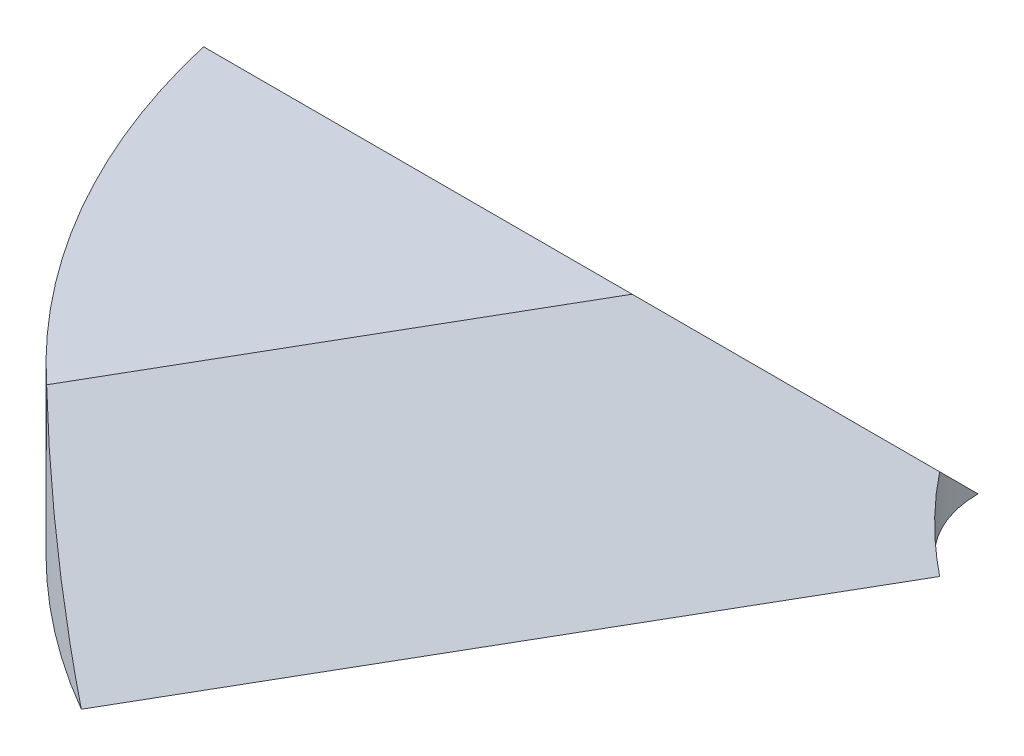
ISO-10303-21;
HEADER;
FILE_DESCRIPTION(('STEP AP214'),'2;1');
FILE_NAME('part.step','',(''),(''),'','','');
FILE_SCHEMA(('AUTOMOTIVE_DESIGN { 1 0 10303 214 1 1 1 1 }'));
ENDSEC;
DATA;
#1=APPLICATION_CONTEXT('core data for automotive mechanical design processes');
#2=APPLICATION_PROTOCOL_DEFINITION('international standard','automotive_design',2000,#1);
#3=PRODUCT_CONTEXT('',#1,'mechanical');
#4=PRODUCT('Part','Part','',(#3));
#5=PRODUCT_RELATED_PRODUCT_CATEGORY('part','',(#4));
#6=PRODUCT_DEFINITION_FORMATION('','',#4);
#7=PRODUCT_DEFINITION_CONTEXT('part definition',#1,'design');
#8=PRODUCT_DEFINITION('design','',#6,#7);
#9=PRODUCT_DEFINITION_SHAPE('','',#8);
#10=(LENGTH_UNIT() NAMED_UNIT(*) SI_UNIT(.MILLI.,.METRE.));
#11=(NAMED_UNIT(*) PLANE_ANGLE_UNIT() SI_UNIT($,.RADIAN.));
#12=(NAMED_UNIT(*) SI_UNIT($,.STERADIAN.) SOLID_ANGLE_UNIT());
#13=UNCERTAINTY_MEASURE_WITH_UNIT(LENGTH_MEASURE(1.E-05),#10,'distance_accuracy_value','');
#14=(GEOMETRIC_REPRESENTATION_CONTEXT(3) GLOBAL_UNCERTAINTY_ASSIGNED_CONTEXT((#13)) GLOBAL_UNIT_ASSIGNED_CONTEXT((#10,
#11,#12)) REPRESENTATION_CONTEXT('',''));
#15=CARTESIAN_POINT('',(0.,0.,0.));
#16=DIRECTION('',(0.,0.,1.));
#17=DIRECTION('',(1.,0.,0.));
#18=AXIS2_PLACEMENT_3D('',#15,#16,#17);
#19=CARTESIAN_POINT('',(0.,10.,0.));
#20=DIRECTION('',(0.,-1.,0.));
#21=DIRECTION('',(0.,0.,-1.));
#22=AXIS2_PLACEMENT_3D('',#19,#20,#21);
#23=CYLINDRICAL_SURFACE('',#22,6.35);
#24=CARTESIAN_POINT('',(0.,0.,0.));
#25=DIRECTION('',(0.,1.,0.));
#26=DIRECTION('',(0.,0.,1.));
#27=AXIS2_PLACEMENT_3D('',#24,#25,#26);
#28=CIRCLE('',#27,6.35);
#29=CARTESIAN_POINT('',(-6.35,0.,0.));
#30=VERTEX_POINT('',#29);
#31=CARTESIAN_POINT('',(-3.175,0.,5.49926131403119));
#32=VERTEX_POINT('',#31);
#33=EDGE_CURVE('E92',#30,#32,#28,.T.);
#34=ORIENTED_EDGE('',*,*,#33,.F.);
#35=CARTESIAN_POINT('',(0.,0.,0.));
#36=DIRECTION('',(0.,0.707106781186549,-0.707106781186546));
#37=DIRECTION('',(0.,-0.707106781186546,-0.707106781186549));
#38=AXIS2_PLACEMENT_3D('',#35,#36,#37);
#39=ELLIPSE('',#38,8.98025612106914,6.35);
#40=CARTESIAN_POINT('',(-5.49926131403119,3.17499999999999,3.175));
#41=VERTEX_POINT('',#40);
#42=EDGE_CURVE('E52',#41,#30,#39,.F.);
#43=ORIENTED_EDGE('',*,*,#42,.F.);
#44=CARTESIAN_POINT('',(0.,0.,0.));
#45=DIRECTION('',(0.612372435695794,0.707106781186549,0.353553390593273));
#46=DIRECTION('',(0.612372435695796,-0.707106781186546,0.353553390593274));
#47=AXIS2_PLACEMENT_3D('',#44,#45,#46);
#48=ELLIPSE('',#47,8.98025612106914,6.35);
#49=EDGE_CURVE('E98',#41,#32,#48,.T.);
#50=ORIENTED_EDGE('',*,*,#49,.T.);
#51=EDGE_LOOP('',(#34,#43,#50));
#52=FACE_BOUND('',#51,.T.);
#53=ADVANCED_FACE('F41',(#52),#23,.F.);
#54=CARTESIAN_POINT('',(0.,0.,0.));
#55=DIRECTION('',(0.,0.707106781186549,-0.707106781186546));
#56=DIRECTION('',(0.,0.707106781186546,0.707106781186549));
#57=AXIS2_PLACEMENT_3D('',#54,#55,#56);
#58=PLANE('',#57);
#59=DIRECTION('',(-1.,0.,0.));
#60=VECTOR('',#59,1.);
#61=CARTESIAN_POINT('',(0.,0.,0.));
#62=LINE('',#61,#60);
#63=CARTESIAN_POINT('',(-44.45,0.,0.));
#64=VERTEX_POINT('',#63);
#65=EDGE_CURVE('E80',#30,#64,#62,.T.);
#66=ORIENTED_EDGE('',*,*,#65,.T.);
#67=CARTESIAN_POINT('',(0.,0.,0.));
#68=DIRECTION('',(0.,0.707106781186549,-0.707106781186546));
#69=DIRECTION('',(0.,-0.707106781186546,-0.707106781186549));
#70=AXIS2_PLACEMENT_3D('',#67,#68,#69);
#71=ELLIPSE('',#70,62.861792847484,44.45);
#72=CARTESIAN_POINT('',(-43.3105356697421,10.,10.));
#73=VERTEX_POINT('',#72);
#74=EDGE_CURVE('E45',#73,#64,#71,.F.);
#75=ORIENTED_EDGE('',*,*,#74,.F.);
#76=DIRECTION('',(1.,0.,0.));
#77=VECTOR('',#76,1.);
#78=CARTESIAN_POINT('',(0.,10.,10.));
#79=LINE('',#78,#77);
#80=CARTESIAN_POINT('',(-17.3205080756888,10.,10.));
#81=VERTEX_POINT('',#80);
#82=EDGE_CURVE('E60',#81,#73,#79,.F.);
#83=ORIENTED_EDGE('',*,*,#82,.F.);
#84=DIRECTION('',(0.774596669241484,-0.447213595499957,-0.447213595499958));
#85=VECTOR('',#84,1.);
#86=CARTESIAN_POINT('',(0.,0.,0.));
#87=LINE('',#86,#85);
#88=EDGE_CURVE('E11',#41,#81,#87,.F.);
#89=ORIENTED_EDGE('',*,*,#88,.F.);
#90=ORIENTED_EDGE('',*,*,#42,.T.);
#91=EDGE_LOOP('',(#66,#75,#83,#89,#90));
#92=FACE_BOUND('',#91,.T.);
#93=ADVANCED_FACE('F43',(#92),#58,.T.);
#94=CARTESIAN_POINT('',(0.,10.,0.));
#95=DIRECTION('',(0.,-1.,0.));
#96=DIRECTION('',(0.,0.,-1.));
#97=AXIS2_PLACEMENT_3D('',#94,#95,#96);
#98=CYLINDRICAL_SURFACE('',#97,44.45);
#99=CARTESIAN_POINT('',(0.,0.,0.));
#100=DIRECTION('',(0.,1.,0.));
#101=DIRECTION('',(0.,0.,1.));
#102=AXIS2_PLACEMENT_3D('',#99,#100,#101);
#103=CIRCLE('',#102,44.45);
#104=CARTESIAN_POINT('',(-22.225,0.,38.4948291982183));
#105=VERTEX_POINT('',#104);
#106=EDGE_CURVE('E95',#64,#105,#103,.T.);
#107=ORIENTED_EDGE('',*,*,#106,.T.);
#108=CARTESIAN_POINT('',(0.,0.,0.));
#109=DIRECTION('',(0.612372435695794,0.707106781186549,0.353553390593273));
#110=DIRECTION('',(0.612372435695796,-0.707106781186546,0.353553390593274));
#111=AXIS2_PLACEMENT_3D('',#108,#109,#110);
#112=ELLIPSE('',#111,62.861792847484,44.45);
#113=CARTESIAN_POINT('',(-30.3155218727155,10.,32.5080241415087));
#114=VERTEX_POINT('',#113);
#115=EDGE_CURVE('E109',#114,#105,#112,.T.);
#116=ORIENTED_EDGE('',*,*,#115,.F.);
#117=CARTESIAN_POINT('',(0.,10.,0.));
#118=DIRECTION('',(0.,1.,0.));
#119=DIRECTION('',(0.,0.,1.));
#120=AXIS2_PLACEMENT_3D('',#117,#118,#119);
#121=CIRCLE('',#120,44.45);
#122=EDGE_CURVE('E102',#73,#114,#121,.T.);
#123=ORIENTED_EDGE('',*,*,#122,.F.);
#124=ORIENTED_EDGE('',*,*,#74,.T.);
#125=EDGE_LOOP('',(#107,#116,#123,#124));
#126=FACE_BOUND('',#125,.T.);
#127=ADVANCED_FACE('F124',(#126),#98,.T.);
#128=CARTESIAN_POINT('',(0.,0.,0.));
#129=DIRECTION('',(0.612372435695794,0.707106781186549,0.353553390593273));
#130=DIRECTION('',(-0.755928946018456,0.654653670707976,0.));
#131=AXIS2_PLACEMENT_3D('',#128,#129,#130);
#132=PLANE('',#131);
#133=DIRECTION('',(-0.5,0.,0.866025403784439));
#134=VECTOR('',#133,1.);
#135=CARTESIAN_POINT('',(0.,0.,0.));
#136=LINE('',#135,#134);
#137=EDGE_CURVE('E106',#32,#105,#136,.T.);
#138=ORIENTED_EDGE('',*,*,#137,.F.);
#139=ORIENTED_EDGE('',*,*,#49,.F.);
#140=ORIENTED_EDGE('',*,*,#88,.T.);
#141=DIRECTION('',(-0.5,0.,0.866025403784439));
#142=VECTOR('',#141,1.);
#143=CARTESIAN_POINT('',(-8.66025403784442,10.,-5.00000000000002));
#144=LINE('',#143,#142);
#145=EDGE_CURVE('E112',#81,#114,#144,.T.);
#146=ORIENTED_EDGE('',*,*,#145,.T.);
#147=ORIENTED_EDGE('',*,*,#115,.T.);
#148=EDGE_LOOP('',(#138,#139,#140,#146,#147));
#149=FACE_BOUND('',#148,.T.);
#150=ADVANCED_FACE('F126',(#149),#132,.T.);
#151=CARTESIAN_POINT('',(0.,10.,0.));
#152=DIRECTION('',(0.,1.,0.));
#153=DIRECTION('',(0.,0.,1.));
#154=AXIS2_PLACEMENT_3D('',#151,#152,#153);
#155=PLANE('',#154);
#156=ORIENTED_EDGE('',*,*,#145,.F.);
#157=ORIENTED_EDGE('',*,*,#82,.T.);
#158=ORIENTED_EDGE('',*,*,#122,.T.);
#159=EDGE_LOOP('',(#156,#157,#158));
#160=FACE_BOUND('',#159,.T.);
#161=ADVANCED_FACE('F122',(#160),#155,.T.);
#162=CARTESIAN_POINT('',(0.,0.,0.));
#163=DIRECTION('',(0.,1.,0.));
#164=DIRECTION('',(0.,0.,1.));
#165=AXIS2_PLACEMENT_3D('',#162,#163,#164);
#166=PLANE('',#165);
#167=ORIENTED_EDGE('',*,*,#33,.T.);
#168=ORIENTED_EDGE('',*,*,#137,.T.);
#169=ORIENTED_EDGE('',*,*,#106,.F.);
#170=ORIENTED_EDGE('',*,*,#65,.F.);
#171=EDGE_LOOP('',(#167,#168,#169,#170));
#172=FACE_BOUND('',#171,.T.);
#173=ADVANCED_FACE('F90',(#172),#166,.F.);
#174=CLOSED_SHELL('',(#53,#93,#127,#150,#161,#173));
#175=MANIFOLD_SOLID_BREP('B2',#174);
#176=ADVANCED_BREP_SHAPE_REPRESENTATION('',(#18,#175),#14);
#177=SHAPE_DEFINITION_REPRESENTATION(#9,#176);
ENDSEC;
END-ISO-10303-21;
